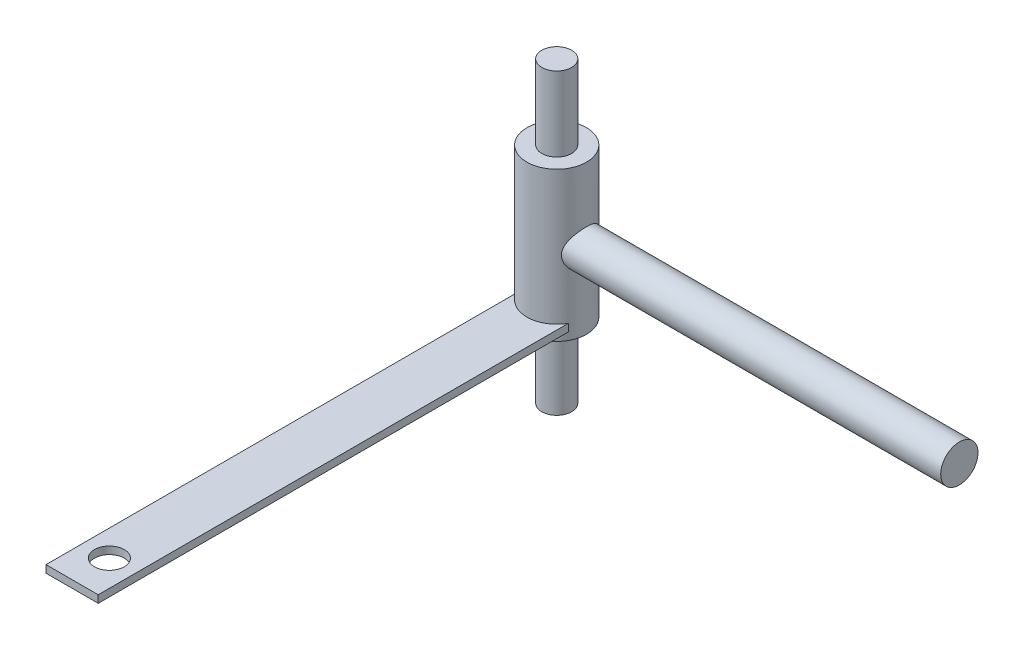
ISO-10303-21;
HEADER;
FILE_DESCRIPTION(('STEP AP214'),'2;1');
FILE_NAME('part.step','',(''),(''),'','','');
FILE_SCHEMA(('AUTOMOTIVE_DESIGN { 1 0 10303 214 1 1 1 1 }'));
ENDSEC;
DATA;
#1=APPLICATION_CONTEXT('core data for automotive mechanical design processes');
#2=APPLICATION_PROTOCOL_DEFINITION('international standard','automotive_design',2000,#1);
#3=PRODUCT_CONTEXT('',#1,'mechanical');
#4=PRODUCT('Part','Part','',(#3));
#5=PRODUCT_RELATED_PRODUCT_CATEGORY('part','',(#4));
#6=PRODUCT_DEFINITION_FORMATION('','',#4);
#7=PRODUCT_DEFINITION_CONTEXT('part definition',#1,'design');
#8=PRODUCT_DEFINITION('design','',#6,#7);
#9=PRODUCT_DEFINITION_SHAPE('','',#8);
#10=(LENGTH_UNIT() NAMED_UNIT(*) SI_UNIT(.MILLI.,.METRE.));
#11=(NAMED_UNIT(*) PLANE_ANGLE_UNIT() SI_UNIT($,.RADIAN.));
#12=(NAMED_UNIT(*) SI_UNIT($,.STERADIAN.) SOLID_ANGLE_UNIT());
#13=UNCERTAINTY_MEASURE_WITH_UNIT(LENGTH_MEASURE(1.E-05),#10,'distance_accuracy_value','');
#14=(GEOMETRIC_REPRESENTATION_CONTEXT(3) GLOBAL_UNCERTAINTY_ASSIGNED_CONTEXT((#13)) GLOBAL_UNIT_ASSIGNED_CONTEXT((#10,
#11,#12)) REPRESENTATION_CONTEXT('',''));
#15=CARTESIAN_POINT('',(0.,0.,0.));
#16=DIRECTION('',(0.,0.,1.));
#17=DIRECTION('',(1.,0.,0.));
#18=AXIS2_PLACEMENT_3D('',#15,#16,#17);
#19=CARTESIAN_POINT('',(0.,20.,0.));
#20=DIRECTION('',(0.,-1.,0.));
#21=DIRECTION('',(0.,0.,-1.));
#22=AXIS2_PLACEMENT_3D('',#19,#20,#21);
#23=CYLINDRICAL_SURFACE('',#22,8.);
#24=CARTESIAN_POINT('',(6.2449979983984,0.,5.));
#25=CARTESIAN_POINT('',(6.24499999083318,-0.124309997084916,4.99999874728376));
#26=CARTESIAN_POINT('',(6.24872594235153,-0.248643911922182,4.99535477639502));
#27=CARTESIAN_POINT('',(6.26346233698878,-0.49624234521784,4.97686385741702));
#28=CARTESIAN_POINT('',(6.27447707053879,-0.619506190474289,4.96301148892208));
#29=CARTESIAN_POINT('',(6.30332817855701,-0.864132894108489,4.92631685582622));
#30=CARTESIAN_POINT('',(6.32117831167981,-0.985491401070756,4.90345645667282));
#31=CARTESIAN_POINT('',(6.36295500797281,-1.22521846002732,4.84912073775945));
#32=CARTESIAN_POINT('',(6.38688460836052,-1.34358548492504,4.81764111134031));
#33=CARTESIAN_POINT('',(6.46598710467671,-1.69098285176997,4.7115563432738));
#34=CARTESIAN_POINT('',(6.52878844336903,-1.91472159134201,4.6249307188155));
#35=CARTESIAN_POINT('',(6.66732308206754,-2.34407629105235,4.42286683667302));
#36=CARTESIAN_POINT('',(6.74305673480881,-2.54969175663766,4.30742779304936));
#37=CARTESIAN_POINT('',(6.91118002626909,-2.9674414130167,4.03296948836377));
#38=CARTESIAN_POINT('',(7.00444112628932,-3.17674952950574,3.87018134056582));
#39=CARTESIAN_POINT('',(7.19012524520994,-3.5675602565304,3.51319765959103));
#40=CARTESIAN_POINT('',(7.28254746874407,-3.74903864049325,3.31897506071619));
#41=CARTESIAN_POINT('',(7.41988971846401,-4.00760626149244,2.99356128179164));
#42=CARTESIAN_POINT('',(7.46785190700925,-4.09554829341698,2.87212880091628));
#43=CARTESIAN_POINT('',(7.55971876275306,-4.2607595171728,2.62078661715024));
#44=CARTESIAN_POINT('',(7.60362512973126,-4.33803318685166,2.49088050482952));
#45=CARTESIAN_POINT('',(7.68611478127736,-4.48104536831486,2.22333771815377));
#46=CARTESIAN_POINT('',(7.72470066932016,-4.54678952615798,2.08570487145723));
#47=CARTESIAN_POINT('',(7.79539753077303,-4.66588913640084,1.80358193532003));
#48=CARTESIAN_POINT('',(7.82750968154027,-4.71924684175159,1.6590930986712));
#49=CARTESIAN_POINT('',(7.88132879110577,-4.8079574186921,1.37943032429723));
#50=CARTESIAN_POINT('',(7.90376135583819,-4.84458864196752,1.24480106420069));
#51=CARTESIAN_POINT('',(7.94191844310852,-4.90659427549434,0.972050692903698));
#52=CARTESIAN_POINT('',(7.95764407963578,-4.93197055516711,0.833930165626438));
#53=CARTESIAN_POINT('',(7.98191012055643,-4.97102838824165,0.555534462309618));
#54=CARTESIAN_POINT('',(7.9904564434862,-4.98471957483722,0.415261158337185));
#55=CARTESIAN_POINT('',(8.00011955525847,-5.00019508535282,0.133810084943768));
#56=CARTESIAN_POINT('',(8.00123719925945,-5.00198077978344,-0.00736757849820934));
#57=CARTESIAN_POINT('',(7.99636544353032,-4.99418306842006,-0.270239609899376));
#58=CARTESIAN_POINT('',(7.99131217584322,-4.9860972278415,-0.391999310072934));
#59=CARTESIAN_POINT('',(7.97573898833036,-4.96109950689231,-0.63429359230614));
#60=CARTESIAN_POINT('',(7.96521743178982,-4.94418498400023,-0.754827796543429));
#61=CARTESIAN_POINT('',(7.93894787928476,-4.90175195667388,-0.9937504162903));
#62=CARTESIAN_POINT('',(7.92320165200919,-4.8762363638823,-1.11213954368103));
#63=CARTESIAN_POINT('',(7.88683283084566,-4.81691536004192,-1.34607315554106));
#64=CARTESIAN_POINT('',(7.86620835217571,-4.78310674467799,-1.46161652141072));
#65=CARTESIAN_POINT('',(7.79753837345255,-4.66961406787293,-1.80341623892686));
#66=CARTESIAN_POINT('',(7.74273886956257,-4.57793007291278,-2.02447250488061));
#67=CARTESIAN_POINT('',(7.6194209119633,-4.36611560771666,-2.44811588786114));
#68=CARTESIAN_POINT('',(7.55089933332867,-4.24597865675437,-2.6506987826293));
#69=CARTESIAN_POINT('',(7.39573414184525,-3.96389668023518,-3.05883635403528));
#70=CARTESIAN_POINT('',(7.30789649394851,-3.79860933546551,-3.26162345770391));
#71=CARTESIAN_POINT('',(7.12780216070677,-3.43944259665051,-3.63842034253163));
#72=CARTESIAN_POINT('',(7.0355391870356,-3.24552165003414,-3.81238750882611));
#73=CARTESIAN_POINT('',(6.89398778931581,-2.92199806035766,-4.05999923159469));
#74=CARTESIAN_POINT('',(6.84343529038729,-2.80103153254676,-4.14440430037547));
#75=CARTESIAN_POINT('',(6.7450499014227,-2.5512511400869,-4.30267035241461));
#76=CARTESIAN_POINT('',(6.69721752335299,-2.42243580756731,-4.37652935467605));
#77=CARTESIAN_POINT('',(6.60608014442446,-2.15770926568204,-4.51291782494085));
#78=CARTESIAN_POINT('',(6.56276754252838,-2.02181056536115,-4.57546644816391));
#79=CARTESIAN_POINT('',(6.48238923774268,-1.74330768244433,-4.6886516739402));
#80=CARTESIAN_POINT('',(6.44532349757936,-1.60070353986484,-4.7392883475702));
#81=CARTESIAN_POINT('',(6.3879911088914,-1.34808415551627,-4.81614194168603));
#82=CARTESIAN_POINT('',(6.36587062744548,-1.23937010533179,-4.84527833481626));
#83=CARTESIAN_POINT('',(6.3267200135842,-1.01935900201234,-4.89628944573215));
#84=CARTESIAN_POINT('',(6.30968872571675,-0.908062541381968,-4.91816581196151));
#85=CARTESIAN_POINT('',(6.2813224765214,-0.683654493148006,-4.95434333722363));
#86=CARTESIAN_POINT('',(6.26998098512218,-0.570545140796211,-4.96865318123363));
#87=CARTESIAN_POINT('',(6.25339132178237,-0.343158274667134,-4.98951663397229));
#88=CARTESIAN_POINT('',(6.24814339794355,-0.228880713516906,-4.99606992689043));
#89=CARTESIAN_POINT('',(6.24394563972607,0.000213756327469843,-5.00131530513999));
#90=CARTESIAN_POINT('',(6.2450091194138,0.115031294285455,-4.99999077198392));
#91=CARTESIAN_POINT('',(6.25342323341975,0.34411058983996,-4.98946310366481));
#92=CARTESIAN_POINT('',(6.26077617711313,0.458372127783275,-4.98025707456074));
#93=CARTESIAN_POINT('',(6.28148941326477,0.685492435641885,-4.95410620951325));
#94=CARTESIAN_POINT('',(6.29485173090555,0.798350719467862,-4.9371587646522));
#95=CARTESIAN_POINT('',(6.32708655414446,1.02190368194708,-4.8957794498311));
#96=CARTESIAN_POINT('',(6.3459613393153,1.13259744525952,-4.87134448334739));
#97=CARTESIAN_POINT('',(6.40919739263554,1.45674114316006,-4.78821642821574));
#98=CARTESIAN_POINT('',(6.46057720915498,1.6662777271024,-4.71921780239627));
#99=CARTESIAN_POINT('',(6.57662484324882,2.07118631830434,-4.55609149726001));
#100=CARTESIAN_POINT('',(6.6412973751829,2.26655326684989,-4.46195489902188));
#101=CARTESIAN_POINT('',(6.79148506979738,2.67720575477837,-4.23062377482239));
#102=CARTESIAN_POINT('',(6.87862419429458,2.88920195195314,-4.08864375810928));
#103=CARTESIAN_POINT('',(7.05576916354209,3.28876845285956,-3.77473221644168));
#104=CARTESIAN_POINT('',(7.14577790264,3.47631305761312,-3.60276961587649));
#105=CARTESIAN_POINT('',(7.28444679190235,3.75109437385404,-3.30924585333197));
#106=CARTESIAN_POINT('',(7.3346230901993,3.84742308399405,-3.19677534649598));
#107=CARTESIAN_POINT('',(7.43214539316412,4.03023211498251,-2.96297696798608));
#108=CARTESIAN_POINT('',(7.47949245970999,4.11671614194503,-2.84165245789285));
#109=CARTESIAN_POINT('',(7.57009743381039,4.27912544276188,-2.59064393379972));
#110=CARTESIAN_POINT('',(7.61335451021155,4.35504857193848,-2.46095822963468));
#111=CARTESIAN_POINT('',(7.69452475176042,4.49544110368957,-2.19402109584822));
#112=CARTESIAN_POINT('',(7.73244126265916,4.55991768393769,-2.05677447863483));
#113=CARTESIAN_POINT('',(7.79976180045409,4.67313922374355,-1.78389488579443));
#114=CARTESIAN_POINT('',(7.82953658856128,4.72258893611767,-1.64864631402092));
#115=CARTESIAN_POINT('',(7.88249738910155,4.80988250173737,-1.37327166975237));
#116=CARTESIAN_POINT('',(7.90568721484267,4.84773307297854,-1.2331484731144));
#117=CARTESIAN_POINT('',(7.94476970960063,4.91121075887916,-0.949284871547718));
#118=CARTESIAN_POINT('',(7.96066874338032,4.93684853590452,-0.805547737630325));
#119=CARTESIAN_POINT('',(7.98468098207153,4.97547600812264,-0.515747890604359));
#120=CARTESIAN_POINT('',(7.99279547496114,4.98846779564148,-0.369685566273095));
#121=CARTESIAN_POINT('',(8.00036899836203,5.0005918204771,-0.0984542398463481));
#122=CARTESIAN_POINT('',(8.00093085905799,5.00148999709849,0.0266091901107878));
#123=CARTESIAN_POINT('',(7.99619997327325,4.99391869226614,0.276384426548502));
#124=CARTESIAN_POINT('',(7.99090543949389,4.98544635104714,0.401096114033592));
#125=CARTESIAN_POINT('',(7.97459103015405,4.95925462589747,0.649105048465708));
#126=CARTESIAN_POINT('',(7.96357367253312,4.9415393086947,0.772402893113274));
#127=CARTESIAN_POINT('',(7.93607401526798,4.89709863543925,1.01678782002796));
#128=CARTESIAN_POINT('',(7.91958960822669,4.87036980485838,1.13787403075122));
#129=CARTESIAN_POINT('',(7.88220417715129,4.80933512611737,1.3727696067634));
#130=CARTESIAN_POINT('',(7.86147899328625,4.77532902296419,1.486685097437));
#131=CARTESIAN_POINT('',(7.8157172820285,4.69961071566991,1.71105112688166));
#132=CARTESIAN_POINT('',(7.79067928081094,4.65789587685613,1.82150046585626));
#133=CARTESIAN_POINT('',(7.70981708144695,4.52179700785277,2.14674322952902));
#134=CARTESIAN_POINT('',(7.64821482975006,4.41641101660221,2.3556119089249));
#135=CARTESIAN_POINT('',(7.50700801995937,4.1673460340312,2.77466231937412));
#136=CARTESIAN_POINT('',(7.42619858107808,4.02082779517783,2.98273013480178));
#137=CARTESIAN_POINT('',(7.2573471375721,3.6996977630728,3.37285679634255));
#138=CARTESIAN_POINT('',(7.16929702745266,3.52505426989102,3.55488585185797));
#139=CARTESIAN_POINT('',(6.98001614835192,3.12352869133323,3.91489797533942));
#140=CARTESIAN_POINT('',(6.87871489286988,2.89274538552561,4.08851588919805));
#141=CARTESIAN_POINT('',(6.68699282488335,2.40144255795418,4.3950903074783));
#142=CARTESIAN_POINT('',(6.59656601160477,2.14093959230367,4.52806930044201));
#143=CARTESIAN_POINT('',(6.45719150743099,1.65432760274299,4.72397005512007));
#144=CARTESIAN_POINT('',(6.40349524541685,1.43325185965496,4.79586701428079));
#145=CARTESIAN_POINT('',(6.33898756748728,1.09324362690463,4.88041603953431));
#146=CARTESIAN_POINT('',(6.32016868842665,0.978627920072953,4.90470355408434));
#147=CARTESIAN_POINT('',(6.28849738412123,0.747193668970045,4.94524770814465));
#148=CARTESIAN_POINT('',(6.27564188891545,0.630376290428755,4.9615084801139));
#149=CARTESIAN_POINT('',(6.25906589814134,0.427895086979101,4.9823903295282));
#150=CARTESIAN_POINT('',(6.25380210027526,0.342553322442731,4.98898701036639));
#151=CARTESIAN_POINT('',(6.24676702410079,0.171478227136942,4.99779282932784));
#152=CARTESIAN_POINT('',(6.24499662408473,0.0857448033275004,5.00000086408101));
#153=CARTESIAN_POINT('',(6.2449979983984,0.,5.));
#154=B_SPLINE_CURVE_WITH_KNOTS('',3,(#24,#25,#26,#27,#28,#29,#30,#31,#32,#33,#34,#35,#36,#37,
#38,#39,#40,#41,#42,#43,#44,#45,#46,#47,#48,#49,#50,#51,#52,#53,#54,#55,#56,#57,#58,#59,#60,#61,
#62,#63,#64,#65,#66,#67,#68,#69,#70,#71,#72,#73,#74,#75,#76,#77,#78,#79,#80,#81,#82,#83,#84,#85,
#86,#87,#88,#89,#90,#91,#92,#93,#94,#95,#96,#97,#98,#99,#100,#101,#102,#103,#104,#105,#106,#107,
#108,#109,#110,#111,#112,#113,#114,#115,#116,#117,#118,#119,#120,#121,#122,#123,#124,#125,#126,
#127,#128,#129,#130,#131,#132,#133,#134,#135,#136,#137,#138,#139,#140,#141,#142,#143,#144,#145,
#146,#147,#148,#149,#150,#151,#152,#153),.UNSPECIFIED.,.T.,.F.,(4,2,2,2,2,2,2,2,2,2,2,2,2,2,2,2,
2,2,2,2,2,2,2,2,2,2,2,2,2,2,2,2,2,2,2,2,2,2,2,2,2,2,2,2,2,2,2,2,2,2,2,2,2,2,2,2,2,2,2,2,2,2,2,2,
4),(0.,0.372830631717394,0.745880919988992,1.11968608457865,1.49367836553752,2.2343739724708,
2.97508978546025,3.81517657771247,4.65599058786117,5.1276972709508,5.59920535801266,
6.0704818965238,6.54167264805615,6.9650003716167,7.38825775501684,7.8111658669397,
8.2340252946041,8.59998197802636,8.96604825916241,9.33199074341863,9.69807484639391,
10.4313641163756,11.1648205684642,11.9895533165928,12.8154948839412,13.2827866246025,
13.7501660272479,14.2167463086997,14.6833238060682,15.0271003394338,15.3707987622619,
15.7141018213498,16.0574188576537,16.4014603870609,16.7456282964257,17.0899122787371,
17.4343388350078,18.1111129623981,18.7881275281776,19.5940378131019,20.4007884080993,
20.8693475683427,21.337729748067,21.8062069071061,22.2743892571628,22.7148894158782,
23.1551339612148,23.5949934439159,24.0347801378503,24.409509228706,24.7843527137741,
25.1590314139736,25.5338547106938,25.8954875601863,26.2572442370256,26.9801965139639,
27.7781872367985,28.5770837508034,29.4911341692987,30.4046778558642,31.1173375632652,
31.472952845656,31.8283848529182,32.0854860972178,32.3426519723746),.UNSPECIFIED.);
#155=CARTESIAN_POINT('',(6.2449979983984,0.,5.));
#156=VERTEX_POINT('',#155);
#157=EDGE_CURVE('E136',#156,#156,#154,.T.);
#158=ORIENTED_EDGE('',*,*,#157,.F.);
#159=EDGE_LOOP('',(#158));
#160=FACE_BOUND('',#159,.T.);
#161=CARTESIAN_POINT('',(0.,-20.,0.));
#162=DIRECTION('',(0.,1.,0.));
#163=DIRECTION('',(0.,0.,1.));
#164=AXIS2_PLACEMENT_3D('',#161,#162,#163);
#165=CIRCLE('',#164,8.);
#166=CARTESIAN_POINT('',(0.,-20.,8.));
#167=VERTEX_POINT('',#166);
#168=EDGE_CURVE('E110',#167,#167,#165,.T.);
#169=ORIENTED_EDGE('',*,*,#168,.T.);
#170=EDGE_LOOP('',(#169));
#171=FACE_BOUND('',#170,.T.);
#172=CARTESIAN_POINT('',(0.,20.,0.));
#173=DIRECTION('',(0.,1.,0.));
#174=DIRECTION('',(0.,0.,1.));
#175=AXIS2_PLACEMENT_3D('',#172,#173,#174);
#176=CIRCLE('',#175,8.);
#177=CARTESIAN_POINT('',(0.,20.,8.));
#178=VERTEX_POINT('',#177);
#179=EDGE_CURVE('E116',#178,#178,#176,.T.);
#180=ORIENTED_EDGE('',*,*,#179,.F.);
#181=EDGE_LOOP('',(#180));
#182=FACE_BOUND('',#181,.T.);
#183=DIRECTION('',(0.,-1.,0.));
#184=VECTOR('',#183,1.);
#185=CARTESIAN_POINT('',(7.00000000000001,20.,3.87298334620741));
#186=LINE('',#185,#184);
#187=CARTESIAN_POINT('',(7.00000000000001,-18.,3.87298334620741));
#188=VERTEX_POINT('',#187);
#189=CARTESIAN_POINT('',(7.00000000000001,-16.,3.87298334620741));
#190=VERTEX_POINT('',#189);
#191=EDGE_CURVE('E11',#188,#190,#186,.F.);
#192=ORIENTED_EDGE('',*,*,#191,.F.);
#193=CARTESIAN_POINT('',(0.,-18.,0.));
#194=DIRECTION('',(0.,1.,0.));
#195=DIRECTION('',(0.,0.,1.));
#196=AXIS2_PLACEMENT_3D('',#193,#194,#195);
#197=CIRCLE('',#196,8.);
#198=CARTESIAN_POINT('',(-6.99999999999999,-18.,3.87298334620743));
#199=VERTEX_POINT('',#198);
#200=EDGE_CURVE('E148',#199,#188,#197,.T.);
#201=ORIENTED_EDGE('',*,*,#200,.F.);
#202=DIRECTION('',(0.,-1.,0.));
#203=VECTOR('',#202,1.);
#204=CARTESIAN_POINT('',(-6.99999999999999,20.,3.87298334620743));
#205=LINE('',#204,#203);
#206=CARTESIAN_POINT('',(-6.99999999999999,-16.,3.87298334620743));
#207=VERTEX_POINT('',#206);
#208=EDGE_CURVE('E61',#207,#199,#205,.T.);
#209=ORIENTED_EDGE('',*,*,#208,.F.);
#210=CARTESIAN_POINT('',(0.,-16.,0.));
#211=DIRECTION('',(0.,-1.,0.));
#212=DIRECTION('',(1.,0.,0.));
#213=AXIS2_PLACEMENT_3D('',#210,#211,#212);
#214=CIRCLE('',#213,8.);
#215=EDGE_CURVE('E51',#190,#207,#214,.T.);
#216=ORIENTED_EDGE('',*,*,#215,.F.);
#217=EDGE_LOOP('',(#192,#201,#209,#216));
#218=FACE_BOUND('',#217,.T.);
#219=ADVANCED_FACE('F42',(#160,#171,#182,#218),#23,.T.);
#220=CARTESIAN_POINT('',(0.,40.,0.));
#221=DIRECTION('',(0.,-1.,0.));
#222=DIRECTION('',(0.,0.,-1.));
#223=AXIS2_PLACEMENT_3D('',#220,#221,#222);
#224=CYLINDRICAL_SURFACE('',#223,4.);
#225=CARTESIAN_POINT('',(0.,20.,0.));
#226=DIRECTION('',(0.,1.,0.));
#227=DIRECTION('',(0.,0.,1.));
#228=AXIS2_PLACEMENT_3D('',#225,#226,#227);
#229=CIRCLE('',#228,4.);
#230=CARTESIAN_POINT('',(0.,20.,4.));
#231=VERTEX_POINT('',#230);
#232=EDGE_CURVE('E120',#231,#231,#229,.T.);
#233=ORIENTED_EDGE('',*,*,#232,.T.);
#234=EDGE_LOOP('',(#233));
#235=FACE_BOUND('',#234,.T.);
#236=CARTESIAN_POINT('',(0.,40.,0.));
#237=DIRECTION('',(0.,1.,0.));
#238=DIRECTION('',(0.,0.,1.));
#239=AXIS2_PLACEMENT_3D('',#236,#237,#238);
#240=CIRCLE('',#239,4.);
#241=CARTESIAN_POINT('',(0.,40.,4.));
#242=VERTEX_POINT('',#241);
#243=EDGE_CURVE('E124',#242,#242,#240,.T.);
#244=ORIENTED_EDGE('',*,*,#243,.F.);
#245=EDGE_LOOP('',(#244));
#246=FACE_BOUND('',#245,.T.);
#247=ADVANCED_FACE('F44',(#235,#246),#224,.T.);
#248=CARTESIAN_POINT('',(0.,40.,0.));
#249=DIRECTION('',(0.,1.,0.));
#250=DIRECTION('',(0.,0.,1.));
#251=AXIS2_PLACEMENT_3D('',#248,#249,#250);
#252=PLANE('',#251);
#253=ORIENTED_EDGE('',*,*,#243,.T.);
#254=EDGE_LOOP('',(#253));
#255=FACE_BOUND('',#254,.T.);
#256=ADVANCED_FACE('F165',(#255),#252,.T.);
#257=CARTESIAN_POINT('',(0.,20.,0.));
#258=DIRECTION('',(0.,1.,0.));
#259=DIRECTION('',(0.,0.,1.));
#260=AXIS2_PLACEMENT_3D('',#257,#258,#259);
#261=PLANE('',#260);
#262=ORIENTED_EDGE('',*,*,#232,.F.);
#263=EDGE_LOOP('',(#262));
#264=FACE_BOUND('',#263,.T.);
#265=ORIENTED_EDGE('',*,*,#179,.T.);
#266=EDGE_LOOP('',(#265));
#267=FACE_BOUND('',#266,.T.);
#268=ADVANCED_FACE('F162',(#264,#267),#261,.T.);
#269=CARTESIAN_POINT('',(0.,-20.,0.));
#270=DIRECTION('',(0.,1.,0.));
#271=DIRECTION('',(0.,0.,1.));
#272=AXIS2_PLACEMENT_3D('',#269,#270,#271);
#273=PLANE('',#272);
#274=CARTESIAN_POINT('',(0.,-20.,0.));
#275=DIRECTION('',(0.,1.,0.));
#276=DIRECTION('',(0.,0.,1.));
#277=AXIS2_PLACEMENT_3D('',#274,#275,#276);
#278=CIRCLE('',#277,4.);
#279=CARTESIAN_POINT('',(0.,-20.,4.));
#280=VERTEX_POINT('',#279);
#281=EDGE_CURVE('E128',#280,#280,#278,.T.);
#282=ORIENTED_EDGE('',*,*,#281,.T.);
#283=EDGE_LOOP('',(#282));
#284=FACE_BOUND('',#283,.T.);
#285=ORIENTED_EDGE('',*,*,#168,.F.);
#286=EDGE_LOOP('',(#285));
#287=FACE_BOUND('',#286,.T.);
#288=ADVANCED_FACE('F164',(#284,#287),#273,.F.);
#289=CARTESIAN_POINT('',(0.,-40.,0.));
#290=DIRECTION('',(0.,1.,0.));
#291=DIRECTION('',(0.,0.,1.));
#292=AXIS2_PLACEMENT_3D('',#289,#290,#291);
#293=PLANE('',#292);
#294=CARTESIAN_POINT('',(0.,-40.,0.));
#295=DIRECTION('',(0.,1.,0.));
#296=DIRECTION('',(0.,0.,1.));
#297=AXIS2_PLACEMENT_3D('',#294,#295,#296);
#298=CIRCLE('',#297,4.);
#299=CARTESIAN_POINT('',(0.,-40.,4.));
#300=VERTEX_POINT('',#299);
#301=EDGE_CURVE('E129',#300,#300,#298,.T.);
#302=ORIENTED_EDGE('',*,*,#301,.F.);
#303=EDGE_LOOP('',(#302));
#304=FACE_BOUND('',#303,.T.);
#305=ADVANCED_FACE('F168',(#304),#293,.F.);
#306=ORIENTED_EDGE('',*,*,#301,.T.);
#307=EDGE_LOOP('',(#306));
#308=FACE_BOUND('',#307,.T.);
#309=ORIENTED_EDGE('',*,*,#281,.F.);
#310=EDGE_LOOP('',(#309));
#311=FACE_BOUND('',#310,.T.);
#312=ADVANCED_FACE('F159',(#308,#311),#224,.T.);
#313=CARTESIAN_POINT('',(108.,0.,0.));
#314=DIRECTION('',(-1.,0.,0.));
#315=DIRECTION('',(0.,0.,1.));
#316=AXIS2_PLACEMENT_3D('',#313,#314,#315);
#317=CYLINDRICAL_SURFACE('',#316,5.);
#318=CARTESIAN_POINT('',(108.,0.,0.));
#319=DIRECTION('',(1.,0.,0.));
#320=DIRECTION('',(0.,0.,-1.));
#321=AXIS2_PLACEMENT_3D('',#318,#319,#320);
#322=CIRCLE('',#321,5.);
#323=CARTESIAN_POINT('',(108.,0.,-5.));
#324=VERTEX_POINT('',#323);
#325=EDGE_CURVE('E105',#324,#324,#322,.T.);
#326=ORIENTED_EDGE('',*,*,#325,.F.);
#327=EDGE_LOOP('',(#326));
#328=FACE_BOUND('',#327,.T.);
#329=ORIENTED_EDGE('',*,*,#157,.T.);
#330=EDGE_LOOP('',(#329));
#331=FACE_BOUND('',#330,.T.);
#332=ADVANCED_FACE('F153',(#328,#331),#317,.T.);
#333=CARTESIAN_POINT('',(108.,0.,0.));
#334=DIRECTION('',(1.,0.,0.));
#335=DIRECTION('',(0.,0.,-1.));
#336=AXIS2_PLACEMENT_3D('',#333,#334,#335);
#337=PLANE('',#336);
#338=ORIENTED_EDGE('',*,*,#325,.T.);
#339=EDGE_LOOP('',(#338));
#340=FACE_BOUND('',#339,.T.);
#341=ADVANCED_FACE('F158',(#340),#337,.T.);
#342=CARTESIAN_POINT('',(7.00000000000001,-16.,130.));
#343=DIRECTION('',(-1.,0.,0.));
#344=DIRECTION('',(0.,0.,1.));
#345=AXIS2_PLACEMENT_3D('',#342,#343,#344);
#346=PLANE('',#345);
#347=DIRECTION('',(0.,0.,-1.));
#348=VECTOR('',#347,1.);
#349=CARTESIAN_POINT('',(7.00000000000001,-18.,130.));
#350=LINE('',#349,#348);
#351=CARTESIAN_POINT('',(7.00000000000001,-18.,130.));
#352=VERTEX_POINT('',#351);
#353=EDGE_CURVE('E190',#352,#188,#350,.T.);
#354=ORIENTED_EDGE('',*,*,#353,.T.);
#355=ORIENTED_EDGE('',*,*,#191,.T.);
#356=DIRECTION('',(0.,0.,-1.));
#357=VECTOR('',#356,1.);
#358=CARTESIAN_POINT('',(7.00000000000001,-16.,130.));
#359=LINE('',#358,#357);
#360=CARTESIAN_POINT('',(7.00000000000001,-16.,130.));
#361=VERTEX_POINT('',#360);
#362=EDGE_CURVE('E84',#361,#190,#359,.T.);
#363=ORIENTED_EDGE('',*,*,#362,.F.);
#364=DIRECTION('',(0.,1.,0.));
#365=VECTOR('',#364,1.);
#366=CARTESIAN_POINT('',(7.00000000000001,-16.,130.));
#367=LINE('',#366,#365);
#368=EDGE_CURVE('E91',#352,#361,#367,.T.);
#369=ORIENTED_EDGE('',*,*,#368,.F.);
#370=EDGE_LOOP('',(#354,#355,#363,#369));
#371=FACE_BOUND('',#370,.T.);
#372=ADVANCED_FACE('F103',(#371),#346,.F.);
#373=CARTESIAN_POINT('',(-6.99999999999999,-16.,130.));
#374=DIRECTION('',(1.,0.,0.));
#375=DIRECTION('',(0.,0.,-1.));
#376=AXIS2_PLACEMENT_3D('',#373,#374,#375);
#377=PLANE('',#376);
#378=DIRECTION('',(0.,0.,-1.));
#379=VECTOR('',#378,1.);
#380=CARTESIAN_POINT('',(-6.99999999999999,-16.,130.));
#381=LINE('',#380,#379);
#382=CARTESIAN_POINT('',(-6.99999999999999,-16.,130.));
#383=VERTEX_POINT('',#382);
#384=EDGE_CURVE('E86',#383,#207,#381,.T.);
#385=ORIENTED_EDGE('',*,*,#384,.T.);
#386=ORIENTED_EDGE('',*,*,#208,.T.);
#387=DIRECTION('',(0.,0.,-1.));
#388=VECTOR('',#387,1.);
#389=CARTESIAN_POINT('',(-6.99999999999999,-18.,130.));
#390=LINE('',#389,#388);
#391=CARTESIAN_POINT('',(-6.99999999999999,-18.,130.));
#392=VERTEX_POINT('',#391);
#393=EDGE_CURVE('E112',#392,#199,#390,.T.);
#394=ORIENTED_EDGE('',*,*,#393,.F.);
#395=DIRECTION('',(0.,-1.,0.));
#396=VECTOR('',#395,1.);
#397=CARTESIAN_POINT('',(-6.99999999999999,-16.,130.));
#398=LINE('',#397,#396);
#399=EDGE_CURVE('E90',#383,#392,#398,.T.);
#400=ORIENTED_EDGE('',*,*,#399,.F.);
#401=EDGE_LOOP('',(#385,#386,#394,#400));
#402=FACE_BOUND('',#401,.T.);
#403=ADVANCED_FACE('F213',(#402),#377,.F.);
#404=CARTESIAN_POINT('',(-6.99999999999999,-16.,130.));
#405=DIRECTION('',(0.,-1.,0.));
#406=DIRECTION('',(1.,0.,0.));
#407=AXIS2_PLACEMENT_3D('',#404,#405,#406);
#408=PLANE('',#407);
#409=CARTESIAN_POINT('',(0.,-16.,120.));
#410=DIRECTION('',(0.,1.,0.));
#411=DIRECTION('',(-1.,0.,0.));
#412=AXIS2_PLACEMENT_3D('',#409,#410,#411);
#413=CIRCLE('',#412,4.);
#414=CARTESIAN_POINT('',(-4.,-16.,120.));
#415=VERTEX_POINT('',#414);
#416=EDGE_CURVE('E204',#415,#415,#413,.T.);
#417=ORIENTED_EDGE('',*,*,#416,.F.);
#418=EDGE_LOOP('',(#417));
#419=FACE_BOUND('',#418,.T.);
#420=ORIENTED_EDGE('',*,*,#362,.T.);
#421=ORIENTED_EDGE('',*,*,#215,.T.);
#422=ORIENTED_EDGE('',*,*,#384,.F.);
#423=DIRECTION('',(-1.,0.,0.));
#424=VECTOR('',#423,1.);
#425=CARTESIAN_POINT('',(-6.99999999999999,-16.,130.));
#426=LINE('',#425,#424);
#427=EDGE_CURVE('E80',#361,#383,#426,.T.);
#428=ORIENTED_EDGE('',*,*,#427,.F.);
#429=EDGE_LOOP('',(#420,#421,#422,#428));
#430=FACE_BOUND('',#429,.T.);
#431=ADVANCED_FACE('F82',(#419,#430),#408,.F.);
#432=CARTESIAN_POINT('',(-6.99999999999999,-18.,130.));
#433=DIRECTION('',(0.,1.,0.));
#434=DIRECTION('',(0.,0.,1.));
#435=AXIS2_PLACEMENT_3D('',#432,#433,#434);
#436=PLANE('',#435);
#437=CARTESIAN_POINT('',(0.,-18.,120.));
#438=DIRECTION('',(0.,1.,0.));
#439=DIRECTION('',(0.,0.,1.));
#440=AXIS2_PLACEMENT_3D('',#437,#438,#439);
#441=CIRCLE('',#440,4.);
#442=CARTESIAN_POINT('',(0.,-18.,124.));
#443=VERTEX_POINT('',#442);
#444=EDGE_CURVE('E101',#443,#443,#441,.F.);
#445=ORIENTED_EDGE('',*,*,#444,.F.);
#446=EDGE_LOOP('',(#445));
#447=FACE_BOUND('',#446,.T.);
#448=ORIENTED_EDGE('',*,*,#393,.T.);
#449=ORIENTED_EDGE('',*,*,#200,.T.);
#450=ORIENTED_EDGE('',*,*,#353,.F.);
#451=DIRECTION('',(1.,0.,0.));
#452=VECTOR('',#451,1.);
#453=CARTESIAN_POINT('',(-6.99999999999999,-18.,130.));
#454=LINE('',#453,#452);
#455=EDGE_CURVE('E96',#392,#352,#454,.T.);
#456=ORIENTED_EDGE('',*,*,#455,.F.);
#457=EDGE_LOOP('',(#448,#449,#450,#456));
#458=FACE_BOUND('',#457,.T.);
#459=ADVANCED_FACE('F189',(#447,#458),#436,.F.);
#460=CARTESIAN_POINT('',(0.,0.,130.));
#461=DIRECTION('',(0.,0.,1.));
#462=DIRECTION('',(1.,0.,0.));
#463=AXIS2_PLACEMENT_3D('',#460,#461,#462);
#464=PLANE('',#463);
#465=ORIENTED_EDGE('',*,*,#368,.T.);
#466=ORIENTED_EDGE('',*,*,#427,.T.);
#467=ORIENTED_EDGE('',*,*,#399,.T.);
#468=ORIENTED_EDGE('',*,*,#455,.T.);
#469=EDGE_LOOP('',(#465,#466,#467,#468));
#470=FACE_BOUND('',#469,.T.);
#471=ADVANCED_FACE('F94',(#470),#464,.T.);
#472=CARTESIAN_POINT('',(0.,-40.001,120.));
#473=DIRECTION('',(0.,1.,0.));
#474=DIRECTION('',(-1.,0.,0.));
#475=AXIS2_PLACEMENT_3D('',#472,#473,#474);
#476=CYLINDRICAL_SURFACE('',#475,4.);
#477=ORIENTED_EDGE('',*,*,#416,.T.);
#478=EDGE_LOOP('',(#477));
#479=FACE_BOUND('',#478,.T.);
#480=ORIENTED_EDGE('',*,*,#444,.T.);
#481=EDGE_LOOP('',(#480));
#482=FACE_BOUND('',#481,.T.);
#483=ADVANCED_FACE('F209',(#479,#482),#476,.F.);
#484=CLOSED_SHELL('',(#219,#247,#256,#268,#288,#305,#312,#332,#341,#372,#403,#431,#459,#471,#483));
#485=MANIFOLD_SOLID_BREP('B2',#484);
#486=ADVANCED_BREP_SHAPE_REPRESENTATION('',(#18,#485),#14);
#487=SHAPE_DEFINITION_REPRESENTATION(#9,#486);
ENDSEC;
END-ISO-10303-21;
